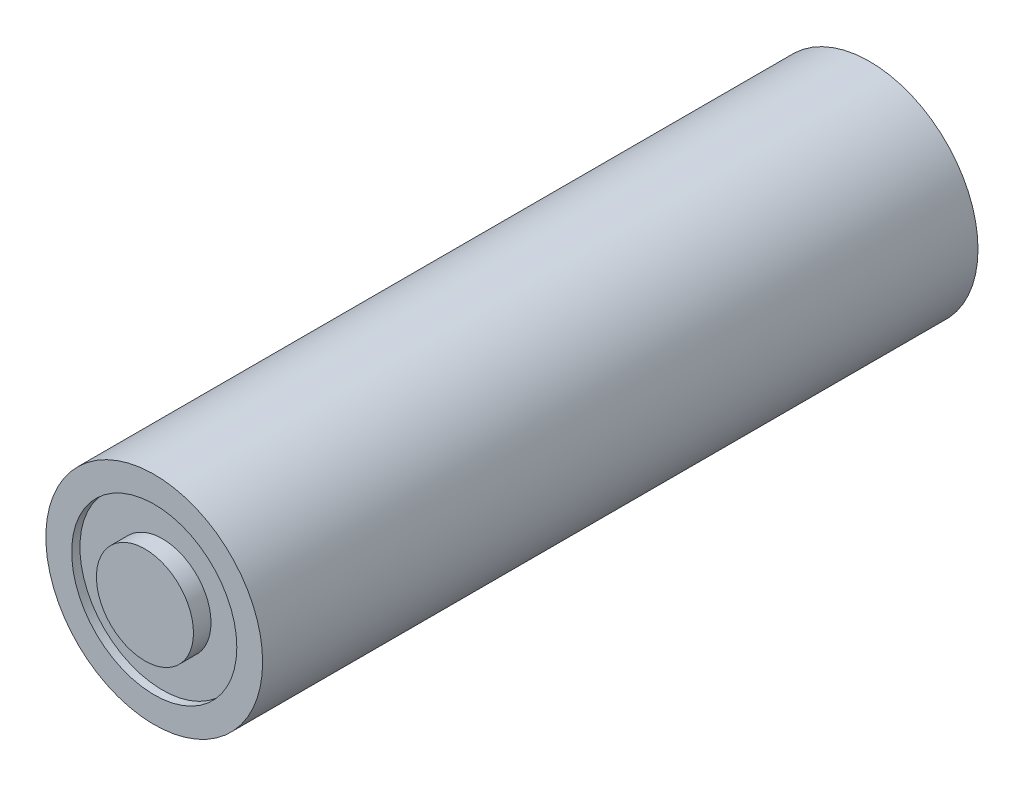
ISO-10303-21;
HEADER;
FILE_DESCRIPTION(('STEP AP214'),'2;1');
FILE_NAME('part.step','',(''),(''),'','','');
FILE_SCHEMA(('AUTOMOTIVE_DESIGN { 1 0 10303 214 1 1 1 1 }'));
ENDSEC;
DATA;
#1=APPLICATION_CONTEXT('core data for automotive mechanical design processes');
#2=APPLICATION_PROTOCOL_DEFINITION('international standard','automotive_design',2000,#1);
#3=PRODUCT_CONTEXT('',#1,'mechanical');
#4=PRODUCT('Part','Part','',(#3));
#5=PRODUCT_RELATED_PRODUCT_CATEGORY('part','',(#4));
#6=PRODUCT_DEFINITION_FORMATION('','',#4);
#7=PRODUCT_DEFINITION_CONTEXT('part definition',#1,'design');
#8=PRODUCT_DEFINITION('design','',#6,#7);
#9=PRODUCT_DEFINITION_SHAPE('','',#8);
#10=(LENGTH_UNIT() NAMED_UNIT(*) SI_UNIT(.MILLI.,.METRE.));
#11=(NAMED_UNIT(*) PLANE_ANGLE_UNIT() SI_UNIT($,.RADIAN.));
#12=(NAMED_UNIT(*) SI_UNIT($,.STERADIAN.) SOLID_ANGLE_UNIT());
#13=UNCERTAINTY_MEASURE_WITH_UNIT(LENGTH_MEASURE(1.E-05),#10,'distance_accuracy_value','');
#14=(GEOMETRIC_REPRESENTATION_CONTEXT(3) GLOBAL_UNCERTAINTY_ASSIGNED_CONTEXT((#13)) GLOBAL_UNIT_ASSIGNED_CONTEXT((#10,
#11,#12)) REPRESENTATION_CONTEXT('',''));
#15=CARTESIAN_POINT('',(0.,0.,0.));
#16=DIRECTION('',(0.,0.,1.));
#17=DIRECTION('',(1.,0.,0.));
#18=AXIS2_PLACEMENT_3D('',#15,#16,#17);
#19=CARTESIAN_POINT('',(0.,0.,68.50000016));
#20=DIRECTION('',(0.,0.,1.));
#21=DIRECTION('',(1.,0.,0.));
#22=AXIS2_PLACEMENT_3D('',#19,#20,#21);
#23=PLANE('',#22);
#24=CARTESIAN_POINT('',(0.,0.,68.50000016));
#25=DIRECTION('',(0.,0.,1.));
#26=DIRECTION('',(1.,0.,0.));
#27=AXIS2_PLACEMENT_3D('',#24,#25,#26);
#28=CIRCLE('',#27,4.7);
#29=CARTESIAN_POINT('',(4.7,0.,68.50000016));
#30=VERTEX_POINT('',#29);
#31=EDGE_CURVE('E41',#30,#30,#28,.T.);
#32=ORIENTED_EDGE('',*,*,#31,.F.);
#33=EDGE_LOOP('',(#32));
#34=FACE_BOUND('',#33,.T.);
#35=CARTESIAN_POINT('',(0.,0.,68.50000016));
#36=DIRECTION('',(0.,0.,1.));
#37=DIRECTION('',(1.,0.,0.));
#38=AXIS2_PLACEMENT_3D('',#35,#36,#37);
#39=CIRCLE('',#38,8.);
#40=CARTESIAN_POINT('',(8.,0.,68.50000016));
#41=VERTEX_POINT('',#40);
#42=EDGE_CURVE('E10',#41,#41,#39,.F.);
#43=ORIENTED_EDGE('',*,*,#42,.F.);
#44=EDGE_LOOP('',(#43));
#45=FACE_BOUND('',#44,.T.);
#46=ADVANCED_FACE('F34',(#34,#45),#23,.T.);
#47=CARTESIAN_POINT('',(0.,0.,70.20000016));
#48=DIRECTION('',(0.,0.,-1.));
#49=DIRECTION('',(-1.,0.,0.));
#50=AXIS2_PLACEMENT_3D('',#47,#48,#49);
#51=CYLINDRICAL_SURFACE('',#50,4.7);
#52=CARTESIAN_POINT('',(0.,0.,70.20000016));
#53=DIRECTION('',(0.,0.,1.));
#54=DIRECTION('',(1.,0.,0.));
#55=AXIS2_PLACEMENT_3D('',#52,#53,#54);
#56=CIRCLE('',#55,4.7);
#57=CARTESIAN_POINT('',(4.7,0.,70.20000016));
#58=VERTEX_POINT('',#57);
#59=EDGE_CURVE('E50',#58,#58,#56,.T.);
#60=ORIENTED_EDGE('',*,*,#59,.F.);
#61=EDGE_LOOP('',(#60));
#62=FACE_BOUND('',#61,.T.);
#63=ORIENTED_EDGE('',*,*,#31,.T.);
#64=EDGE_LOOP('',(#63));
#65=FACE_BOUND('',#64,.T.);
#66=ADVANCED_FACE('F74',(#62,#65),#51,.T.);
#67=CARTESIAN_POINT('',(0.,0.,70.20000016));
#68=DIRECTION('',(0.,0.,1.));
#69=DIRECTION('',(1.,0.,0.));
#70=AXIS2_PLACEMENT_3D('',#67,#68,#69);
#71=PLANE('',#70);
#72=ORIENTED_EDGE('',*,*,#59,.T.);
#73=EDGE_LOOP('',(#72));
#74=FACE_BOUND('',#73,.T.);
#75=ADVANCED_FACE('F65',(#74),#71,.T.);
#76=CARTESIAN_POINT('',(0.,0.,69.30000016));
#77=DIRECTION('',(0.,0.,1.));
#78=DIRECTION('',(1.,0.,0.));
#79=AXIS2_PLACEMENT_3D('',#76,#77,#78);
#80=PLANE('',#79);
#81=CARTESIAN_POINT('',(0.,0.,69.30000016));
#82=DIRECTION('',(0.,0.,1.));
#83=DIRECTION('',(1.,0.,0.));
#84=AXIS2_PLACEMENT_3D('',#81,#82,#83);
#85=CIRCLE('',#84,10.5);
#86=CARTESIAN_POINT('',(10.5,0.,69.30000016));
#87=VERTEX_POINT('',#86);
#88=EDGE_CURVE('E54',#87,#87,#85,.T.);
#89=ORIENTED_EDGE('',*,*,#88,.T.);
#90=EDGE_LOOP('',(#89));
#91=FACE_BOUND('',#90,.T.);
#92=CARTESIAN_POINT('',(0.,0.,69.30000016));
#93=DIRECTION('',(0.,0.,1.));
#94=DIRECTION('',(1.,0.,0.));
#95=AXIS2_PLACEMENT_3D('',#92,#93,#94);
#96=CIRCLE('',#95,8.);
#97=CARTESIAN_POINT('',(8.,0.,69.30000016));
#98=VERTEX_POINT('',#97);
#99=EDGE_CURVE('E57',#98,#98,#96,.T.);
#100=ORIENTED_EDGE('',*,*,#99,.F.);
#101=EDGE_LOOP('',(#100));
#102=FACE_BOUND('',#101,.T.);
#103=ADVANCED_FACE('F63',(#91,#102),#80,.T.);
#104=CARTESIAN_POINT('',(0.,0.,69.30000016));
#105=DIRECTION('',(0.,0.,-1.));
#106=DIRECTION('',(-1.,0.,0.));
#107=AXIS2_PLACEMENT_3D('',#104,#105,#106);
#108=CYLINDRICAL_SURFACE('',#107,8.);
#109=ORIENTED_EDGE('',*,*,#99,.T.);
#110=EDGE_LOOP('',(#109));
#111=FACE_BOUND('',#110,.T.);
#112=ORIENTED_EDGE('',*,*,#42,.T.);
#113=EDGE_LOOP('',(#112));
#114=FACE_BOUND('',#113,.T.);
#115=ADVANCED_FACE('F61',(#111,#114),#108,.F.);
#116=CARTESIAN_POINT('',(0.,0.,0.));
#117=DIRECTION('',(0.,0.,1.));
#118=DIRECTION('',(1.,0.,0.));
#119=AXIS2_PLACEMENT_3D('',#116,#117,#118);
#120=PLANE('',#119);
#121=CARTESIAN_POINT('',(0.,0.,0.));
#122=DIRECTION('',(0.,0.,1.));
#123=DIRECTION('',(1.,0.,0.));
#124=AXIS2_PLACEMENT_3D('',#121,#122,#123);
#125=CIRCLE('',#124,10.5);
#126=CARTESIAN_POINT('',(10.5,0.,0.));
#127=VERTEX_POINT('',#126);
#128=EDGE_CURVE('E45',#127,#127,#125,.T.);
#129=ORIENTED_EDGE('',*,*,#128,.F.);
#130=EDGE_LOOP('',(#129));
#131=FACE_BOUND('',#130,.T.);
#132=ADVANCED_FACE('F72',(#131),#120,.F.);
#133=CARTESIAN_POINT('',(0.,0.,68.50000016));
#134=DIRECTION('',(0.,0.,-1.));
#135=DIRECTION('',(-1.,0.,0.));
#136=AXIS2_PLACEMENT_3D('',#133,#134,#135);
#137=CYLINDRICAL_SURFACE('',#136,10.5);
#138=ORIENTED_EDGE('',*,*,#128,.T.);
#139=EDGE_LOOP('',(#138));
#140=FACE_BOUND('',#139,.T.);
#141=ORIENTED_EDGE('',*,*,#88,.F.);
#142=EDGE_LOOP('',(#141));
#143=FACE_BOUND('',#142,.T.);
#144=ADVANCED_FACE('F36',(#140,#143),#137,.T.);
#145=CLOSED_SHELL('',(#46,#66,#75,#103,#115,#132,#144));
#146=MANIFOLD_SOLID_BREP('B2',#145);
#147=ADVANCED_BREP_SHAPE_REPRESENTATION('',(#18,#146),#14);
#148=SHAPE_DEFINITION_REPRESENTATION(#9,#147);
ENDSEC;
END-ISO-10303-21;
